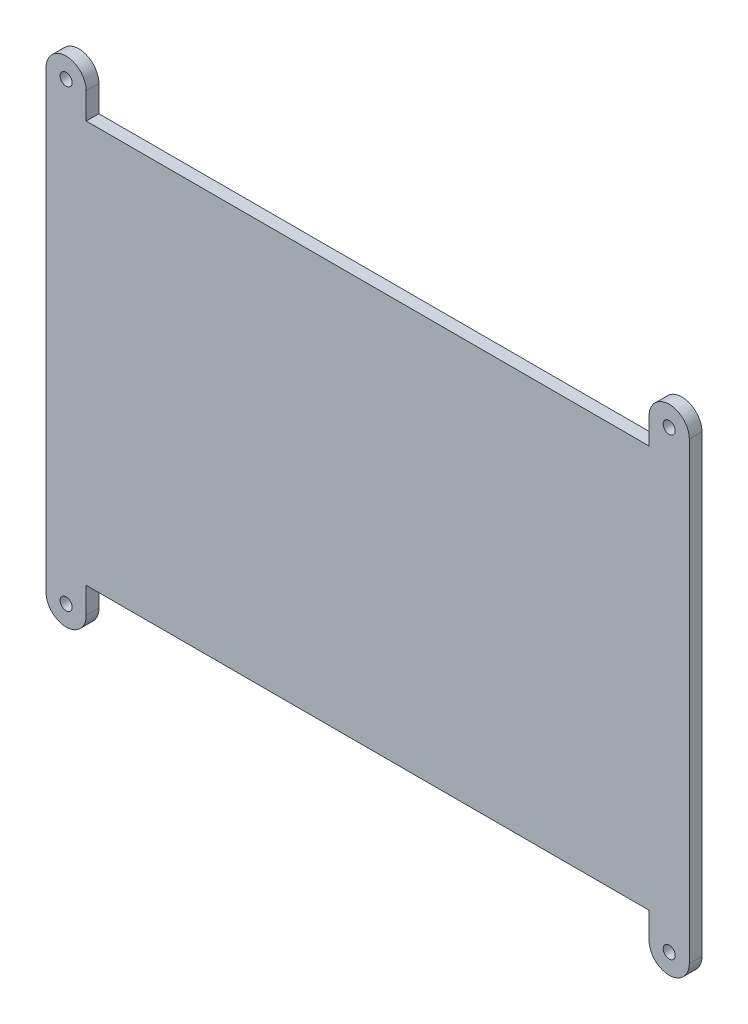
ISO-10303-21;
HEADER;
FILE_DESCRIPTION(('STEP AP214'),'2;1');
FILE_NAME('part.step','',(''),(''),'','','');
FILE_SCHEMA(('AUTOMOTIVE_DESIGN { 1 0 10303 214 1 1 1 1 }'));
ENDSEC;
DATA;
#1=APPLICATION_CONTEXT('core data for automotive mechanical design processes');
#2=APPLICATION_PROTOCOL_DEFINITION('international standard','automotive_design',2000,#1);
#3=PRODUCT_CONTEXT('',#1,'mechanical');
#4=PRODUCT('Part','Part','',(#3));
#5=PRODUCT_RELATED_PRODUCT_CATEGORY('part','',(#4));
#6=PRODUCT_DEFINITION_FORMATION('','',#4);
#7=PRODUCT_DEFINITION_CONTEXT('part definition',#1,'design');
#8=PRODUCT_DEFINITION('design','',#6,#7);
#9=PRODUCT_DEFINITION_SHAPE('','',#8);
#10=(LENGTH_UNIT() NAMED_UNIT(*) SI_UNIT(.MILLI.,.METRE.));
#11=(NAMED_UNIT(*) PLANE_ANGLE_UNIT() SI_UNIT($,.RADIAN.));
#12=(NAMED_UNIT(*) SI_UNIT($,.STERADIAN.) SOLID_ANGLE_UNIT());
#13=UNCERTAINTY_MEASURE_WITH_UNIT(LENGTH_MEASURE(1.E-05),#10,'distance_accuracy_value','');
#14=(GEOMETRIC_REPRESENTATION_CONTEXT(3) GLOBAL_UNCERTAINTY_ASSIGNED_CONTEXT((#13)) GLOBAL_UNIT_ASSIGNED_CONTEXT((#10,
#11,#12)) REPRESENTATION_CONTEXT('',''));
#15=CARTESIAN_POINT('',(0.,0.,0.));
#16=DIRECTION('',(0.,0.,1.));
#17=DIRECTION('',(1.,0.,0.));
#18=AXIS2_PLACEMENT_3D('',#15,#16,#17);
#19=CARTESIAN_POINT('',(-38.1000000000001,28.702,1.6));
#20=DIRECTION('',(0.,0.,-1.));
#21=DIRECTION('',(-1.,0.,0.));
#22=AXIS2_PLACEMENT_3D('',#19,#20,#21);
#23=CYLINDRICAL_SURFACE('',#22,2.5400000000001);
#24=CARTESIAN_POINT('',(-38.1000000000001,28.702,0.));
#25=DIRECTION('',(0.,0.,-1.));
#26=DIRECTION('',(-1.,0.,0.));
#27=AXIS2_PLACEMENT_3D('',#24,#25,#26);
#28=CIRCLE('',#27,2.5400000000001);
#29=CARTESIAN_POINT('',(-40.6400000000001,28.702,0.));
#30=VERTEX_POINT('',#29);
#31=CARTESIAN_POINT('',(-35.5599999999998,28.702,0.));
#32=VERTEX_POINT('',#31);
#33=EDGE_CURVE('E166',#30,#32,#28,.T.);
#34=ORIENTED_EDGE('',*,*,#33,.F.);
#35=DIRECTION('',(0.,0.,-1.));
#36=VECTOR('',#35,1.);
#37=CARTESIAN_POINT('',(-40.6400000000001,28.702,1.6));
#38=LINE('',#37,#36);
#39=CARTESIAN_POINT('',(-40.6400000000001,28.702,1.6));
#40=VERTEX_POINT('',#39);
#41=EDGE_CURVE('E11',#40,#30,#38,.T.);
#42=ORIENTED_EDGE('',*,*,#41,.F.);
#43=CARTESIAN_POINT('',(-38.1000000000001,28.702,1.6));
#44=DIRECTION('',(0.,0.,-1.));
#45=DIRECTION('',(-1.,0.,0.));
#46=AXIS2_PLACEMENT_3D('',#43,#44,#45);
#47=CIRCLE('',#46,2.5400000000001);
#48=CARTESIAN_POINT('',(-35.5599999999998,28.702,1.6));
#49=VERTEX_POINT('',#48);
#50=EDGE_CURVE('E208',#40,#49,#47,.T.);
#51=ORIENTED_EDGE('',*,*,#50,.T.);
#52=DIRECTION('',(0.,0.,-1.));
#53=VECTOR('',#52,1.);
#54=CARTESIAN_POINT('',(-35.5599999999998,28.702,1.6));
#55=LINE('',#54,#53);
#56=EDGE_CURVE('E41',#49,#32,#55,.T.);
#57=ORIENTED_EDGE('',*,*,#56,.T.);
#58=EDGE_LOOP('',(#34,#42,#51,#57));
#59=FACE_BOUND('',#58,.T.);
#60=ADVANCED_FACE('F38',(#59),#23,.T.);
#61=CARTESIAN_POINT('',(-40.6400000000001,28.702,1.6));
#62=DIRECTION('',(1.,0.,0.));
#63=DIRECTION('',(0.,1.,0.));
#64=AXIS2_PLACEMENT_3D('',#61,#62,#63);
#65=PLANE('',#64);
#66=DIRECTION('',(0.,-1.,0.));
#67=VECTOR('',#66,1.);
#68=CARTESIAN_POINT('',(-40.6400000000001,28.702,0.));
#69=LINE('',#68,#67);
#70=CARTESIAN_POINT('',(-40.6400000000001,-28.702,0.));
#71=VERTEX_POINT('',#70);
#72=EDGE_CURVE('E96',#30,#71,#69,.T.);
#73=ORIENTED_EDGE('',*,*,#72,.T.);
#74=DIRECTION('',(0.,0.,-1.));
#75=VECTOR('',#74,1.);
#76=CARTESIAN_POINT('',(-40.6400000000001,-28.702,1.6));
#77=LINE('',#76,#75);
#78=CARTESIAN_POINT('',(-40.6400000000001,-28.702,1.6));
#79=VERTEX_POINT('',#78);
#80=EDGE_CURVE('E48',#79,#71,#77,.T.);
#81=ORIENTED_EDGE('',*,*,#80,.F.);
#82=DIRECTION('',(0.,-1.,0.));
#83=VECTOR('',#82,1.);
#84=CARTESIAN_POINT('',(-40.6400000000001,28.702,1.6));
#85=LINE('',#84,#83);
#86=EDGE_CURVE('E139',#40,#79,#85,.T.);
#87=ORIENTED_EDGE('',*,*,#86,.F.);
#88=ORIENTED_EDGE('',*,*,#41,.T.);
#89=EDGE_LOOP('',(#73,#81,#87,#88));
#90=FACE_BOUND('',#89,.T.);
#91=ADVANCED_FACE('F336',(#90),#65,.F.);
#92=CARTESIAN_POINT('',(-38.0999999999999,-28.702,1.6));
#93=DIRECTION('',(0.,0.,-1.));
#94=DIRECTION('',(-1.,0.,0.));
#95=AXIS2_PLACEMENT_3D('',#92,#93,#94);
#96=CYLINDRICAL_SURFACE('',#95,2.54000000000011);
#97=CARTESIAN_POINT('',(-38.0999999999999,-28.702,0.));
#98=DIRECTION('',(0.,0.,1.));
#99=DIRECTION('',(1.,0.,0.));
#100=AXIS2_PLACEMENT_3D('',#97,#98,#99);
#101=CIRCLE('',#100,2.54000000000011);
#102=CARTESIAN_POINT('',(-35.5599999999998,-28.702,0.));
#103=VERTEX_POINT('',#102);
#104=EDGE_CURVE('E147',#71,#103,#101,.T.);
#105=ORIENTED_EDGE('',*,*,#104,.T.);
#106=DIRECTION('',(0.,0.,-1.));
#107=VECTOR('',#106,1.);
#108=CARTESIAN_POINT('',(-35.5599999999998,-28.702,1.6));
#109=LINE('',#108,#107);
#110=CARTESIAN_POINT('',(-35.5599999999998,-28.702,1.6));
#111=VERTEX_POINT('',#110);
#112=EDGE_CURVE('E144',#111,#103,#109,.T.);
#113=ORIENTED_EDGE('',*,*,#112,.F.);
#114=CARTESIAN_POINT('',(-38.0999999999999,-28.702,1.6));
#115=DIRECTION('',(0.,0.,1.));
#116=DIRECTION('',(1.,0.,0.));
#117=AXIS2_PLACEMENT_3D('',#114,#115,#116);
#118=CIRCLE('',#117,2.54000000000011);
#119=EDGE_CURVE('E134',#79,#111,#118,.T.);
#120=ORIENTED_EDGE('',*,*,#119,.F.);
#121=ORIENTED_EDGE('',*,*,#80,.T.);
#122=EDGE_LOOP('',(#105,#113,#120,#121));
#123=FACE_BOUND('',#122,.T.);
#124=ADVANCED_FACE('F145',(#123),#96,.T.);
#125=CARTESIAN_POINT('',(-35.5599999999999,-25.4,1.6));
#126=DIRECTION('',(1.,0.,0.));
#127=DIRECTION('',(0.,1.,0.));
#128=AXIS2_PLACEMENT_3D('',#125,#126,#127);
#129=PLANE('',#128);
#130=DIRECTION('',(0.,-1.,0.));
#131=VECTOR('',#130,1.);
#132=CARTESIAN_POINT('',(-35.5599999999999,-25.4,0.));
#133=LINE('',#132,#131);
#134=CARTESIAN_POINT('',(-35.5599999999999,-25.4,0.));
#135=VERTEX_POINT('',#134);
#136=EDGE_CURVE('E202',#135,#103,#133,.T.);
#137=ORIENTED_EDGE('',*,*,#136,.F.);
#138=DIRECTION('',(0.,0.,-1.));
#139=VECTOR('',#138,1.);
#140=CARTESIAN_POINT('',(-35.5599999999999,-25.4,1.6));
#141=LINE('',#140,#139);
#142=CARTESIAN_POINT('',(-35.5599999999999,-25.4,1.6));
#143=VERTEX_POINT('',#142);
#144=EDGE_CURVE('E152',#143,#135,#141,.T.);
#145=ORIENTED_EDGE('',*,*,#144,.F.);
#146=DIRECTION('',(0.,-1.,0.));
#147=VECTOR('',#146,1.);
#148=CARTESIAN_POINT('',(-35.5599999999999,-25.4,1.6));
#149=LINE('',#148,#147);
#150=EDGE_CURVE('E138',#143,#111,#149,.T.);
#151=ORIENTED_EDGE('',*,*,#150,.T.);
#152=ORIENTED_EDGE('',*,*,#112,.T.);
#153=EDGE_LOOP('',(#137,#145,#151,#152));
#154=FACE_BOUND('',#153,.T.);
#155=ADVANCED_FACE('F154',(#154),#129,.T.);
#156=CARTESIAN_POINT('',(-35.5599999999999,-25.4,1.6));
#157=DIRECTION('',(0.,1.,0.));
#158=DIRECTION('',(-1.,0.,0.));
#159=AXIS2_PLACEMENT_3D('',#156,#157,#158);
#160=PLANE('',#159);
#161=DIRECTION('',(1.,0.,0.));
#162=VECTOR('',#161,1.);
#163=CARTESIAN_POINT('',(-35.5599999999999,-25.4,0.));
#164=LINE('',#163,#162);
#165=CARTESIAN_POINT('',(35.5599999999999,-25.4,0.));
#166=VERTEX_POINT('',#165);
#167=EDGE_CURVE('E199',#135,#166,#164,.T.);
#168=ORIENTED_EDGE('',*,*,#167,.T.);
#169=DIRECTION('',(0.,0.,-1.));
#170=VECTOR('',#169,1.);
#171=CARTESIAN_POINT('',(35.5599999999999,-25.4,1.6));
#172=LINE('',#171,#170);
#173=CARTESIAN_POINT('',(35.5599999999999,-25.4,1.6));
#174=VERTEX_POINT('',#173);
#175=EDGE_CURVE('E214',#174,#166,#172,.T.);
#176=ORIENTED_EDGE('',*,*,#175,.F.);
#177=DIRECTION('',(1.,0.,0.));
#178=VECTOR('',#177,1.);
#179=CARTESIAN_POINT('',(-35.5599999999999,-25.4,1.6));
#180=LINE('',#179,#178);
#181=EDGE_CURVE('E157',#143,#174,#180,.T.);
#182=ORIENTED_EDGE('',*,*,#181,.F.);
#183=ORIENTED_EDGE('',*,*,#144,.T.);
#184=EDGE_LOOP('',(#168,#176,#182,#183));
#185=FACE_BOUND('',#184,.T.);
#186=ADVANCED_FACE('F245',(#185),#160,.F.);
#187=CARTESIAN_POINT('',(35.5599999999999,-25.4,1.6));
#188=DIRECTION('',(1.,0.,0.));
#189=DIRECTION('',(0.,1.,0.));
#190=AXIS2_PLACEMENT_3D('',#187,#188,#189);
#191=PLANE('',#190);
#192=DIRECTION('',(0.,-1.,0.));
#193=VECTOR('',#192,1.);
#194=CARTESIAN_POINT('',(35.5599999999999,-25.4,0.));
#195=LINE('',#194,#193);
#196=CARTESIAN_POINT('',(35.5599999999998,-28.702,0.));
#197=VERTEX_POINT('',#196);
#198=EDGE_CURVE('E195',#166,#197,#195,.T.);
#199=ORIENTED_EDGE('',*,*,#198,.T.);
#200=DIRECTION('',(0.,0.,-1.));
#201=VECTOR('',#200,1.);
#202=CARTESIAN_POINT('',(35.5599999999998,-28.702,1.6));
#203=LINE('',#202,#201);
#204=CARTESIAN_POINT('',(35.5599999999998,-28.702,1.6));
#205=VERTEX_POINT('',#204);
#206=EDGE_CURVE('E218',#205,#197,#203,.T.);
#207=ORIENTED_EDGE('',*,*,#206,.F.);
#208=DIRECTION('',(0.,-1.,0.));
#209=VECTOR('',#208,1.);
#210=CARTESIAN_POINT('',(35.5599999999999,-25.4,1.6));
#211=LINE('',#210,#209);
#212=EDGE_CURVE('E160',#174,#205,#211,.T.);
#213=ORIENTED_EDGE('',*,*,#212,.F.);
#214=ORIENTED_EDGE('',*,*,#175,.T.);
#215=EDGE_LOOP('',(#199,#207,#213,#214));
#216=FACE_BOUND('',#215,.T.);
#217=ADVANCED_FACE('F248',(#216),#191,.F.);
#218=CARTESIAN_POINT('',(38.0999999999999,-28.702,1.6));
#219=DIRECTION('',(0.,0.,-1.));
#220=DIRECTION('',(-1.,0.,0.));
#221=AXIS2_PLACEMENT_3D('',#218,#219,#220);
#222=CYLINDRICAL_SURFACE('',#221,2.54000000000012);
#223=CARTESIAN_POINT('',(38.0999999999999,-28.702,0.));
#224=DIRECTION('',(0.,0.,-1.));
#225=DIRECTION('',(-1.,0.,0.));
#226=AXIS2_PLACEMENT_3D('',#223,#224,#225);
#227=CIRCLE('',#226,2.54000000000012);
#228=CARTESIAN_POINT('',(40.6400000000001,-28.702,0.));
#229=VERTEX_POINT('',#228);
#230=EDGE_CURVE('E191',#229,#197,#227,.T.);
#231=ORIENTED_EDGE('',*,*,#230,.F.);
#232=DIRECTION('',(0.,0.,-1.));
#233=VECTOR('',#232,1.);
#234=CARTESIAN_POINT('',(40.6400000000001,-28.702,1.6));
#235=LINE('',#234,#233);
#236=CARTESIAN_POINT('',(40.6400000000001,-28.702,1.6));
#237=VERTEX_POINT('',#236);
#238=EDGE_CURVE('E221',#237,#229,#235,.T.);
#239=ORIENTED_EDGE('',*,*,#238,.F.);
#240=CARTESIAN_POINT('',(38.0999999999999,-28.702,1.6));
#241=DIRECTION('',(0.,0.,-1.));
#242=DIRECTION('',(-1.,0.,0.));
#243=AXIS2_PLACEMENT_3D('',#240,#241,#242);
#244=CIRCLE('',#243,2.54000000000012);
#245=EDGE_CURVE('E253',#237,#205,#244,.T.);
#246=ORIENTED_EDGE('',*,*,#245,.T.);
#247=ORIENTED_EDGE('',*,*,#206,.T.);
#248=EDGE_LOOP('',(#231,#239,#246,#247));
#249=FACE_BOUND('',#248,.T.);
#250=ADVANCED_FACE('F352',(#249),#222,.T.);
#251=CARTESIAN_POINT('',(40.6400000000001,28.702,1.6));
#252=DIRECTION('',(1.,0.,0.));
#253=DIRECTION('',(0.,1.,0.));
#254=AXIS2_PLACEMENT_3D('',#251,#252,#253);
#255=PLANE('',#254);
#256=DIRECTION('',(0.,-1.,0.));
#257=VECTOR('',#256,1.);
#258=CARTESIAN_POINT('',(40.6400000000001,28.702,0.));
#259=LINE('',#258,#257);
#260=CARTESIAN_POINT('',(40.6400000000001,28.702,0.));
#261=VERTEX_POINT('',#260);
#262=EDGE_CURVE('E187',#261,#229,#259,.T.);
#263=ORIENTED_EDGE('',*,*,#262,.F.);
#264=DIRECTION('',(0.,0.,-1.));
#265=VECTOR('',#264,1.);
#266=CARTESIAN_POINT('',(40.6400000000001,28.702,1.6));
#267=LINE('',#266,#265);
#268=CARTESIAN_POINT('',(40.6400000000001,28.702,1.6));
#269=VERTEX_POINT('',#268);
#270=EDGE_CURVE('E224',#269,#261,#267,.T.);
#271=ORIENTED_EDGE('',*,*,#270,.F.);
#272=DIRECTION('',(0.,-1.,0.));
#273=VECTOR('',#272,1.);
#274=CARTESIAN_POINT('',(40.6400000000001,28.702,1.6));
#275=LINE('',#274,#273);
#276=EDGE_CURVE('E255',#269,#237,#275,.T.);
#277=ORIENTED_EDGE('',*,*,#276,.T.);
#278=ORIENTED_EDGE('',*,*,#238,.T.);
#279=EDGE_LOOP('',(#263,#271,#277,#278));
#280=FACE_BOUND('',#279,.T.);
#281=ADVANCED_FACE('F355',(#280),#255,.T.);
#282=CARTESIAN_POINT('',(38.0999999999999,28.702,1.6));
#283=DIRECTION('',(0.,0.,-1.));
#284=DIRECTION('',(-1.,0.,0.));
#285=AXIS2_PLACEMENT_3D('',#282,#283,#284);
#286=CYLINDRICAL_SURFACE('',#285,2.5400000000001);
#287=CARTESIAN_POINT('',(38.0999999999999,28.702,0.));
#288=DIRECTION('',(0.,0.,1.));
#289=DIRECTION('',(1.,0.,0.));
#290=AXIS2_PLACEMENT_3D('',#287,#288,#289);
#291=CIRCLE('',#290,2.5400000000001);
#292=CARTESIAN_POINT('',(35.5599999999998,28.702,0.));
#293=VERTEX_POINT('',#292);
#294=EDGE_CURVE('E183',#261,#293,#291,.T.);
#295=ORIENTED_EDGE('',*,*,#294,.T.);
#296=DIRECTION('',(0.,0.,-1.));
#297=VECTOR('',#296,1.);
#298=CARTESIAN_POINT('',(35.5599999999998,28.702,1.6));
#299=LINE('',#298,#297);
#300=CARTESIAN_POINT('',(35.5599999999998,28.702,1.6));
#301=VERTEX_POINT('',#300);
#302=EDGE_CURVE('E227',#301,#293,#299,.T.);
#303=ORIENTED_EDGE('',*,*,#302,.F.);
#304=CARTESIAN_POINT('',(38.0999999999999,28.702,1.6));
#305=DIRECTION('',(0.,0.,1.));
#306=DIRECTION('',(1.,0.,0.));
#307=AXIS2_PLACEMENT_3D('',#304,#305,#306);
#308=CIRCLE('',#307,2.5400000000001);
#309=EDGE_CURVE('E261',#269,#301,#308,.T.);
#310=ORIENTED_EDGE('',*,*,#309,.F.);
#311=ORIENTED_EDGE('',*,*,#270,.T.);
#312=EDGE_LOOP('',(#295,#303,#310,#311));
#313=FACE_BOUND('',#312,.T.);
#314=ADVANCED_FACE('F359',(#313),#286,.T.);
#315=CARTESIAN_POINT('',(35.5599999999999,25.4,1.6));
#316=DIRECTION('',(-1.,0.,0.));
#317=DIRECTION('',(0.,-1.,0.));
#318=AXIS2_PLACEMENT_3D('',#315,#316,#317);
#319=PLANE('',#318);
#320=DIRECTION('',(0.,1.,0.));
#321=VECTOR('',#320,1.);
#322=CARTESIAN_POINT('',(35.5599999999999,25.4,0.));
#323=LINE('',#322,#321);
#324=CARTESIAN_POINT('',(35.5599999999999,25.4,0.));
#325=VERTEX_POINT('',#324);
#326=EDGE_CURVE('E179',#325,#293,#323,.T.);
#327=ORIENTED_EDGE('',*,*,#326,.F.);
#328=DIRECTION('',(0.,0.,-1.));
#329=VECTOR('',#328,1.);
#330=CARTESIAN_POINT('',(35.5599999999999,25.4,1.6));
#331=LINE('',#330,#329);
#332=CARTESIAN_POINT('',(35.5599999999999,25.4,1.6));
#333=VERTEX_POINT('',#332);
#334=EDGE_CURVE('E230',#333,#325,#331,.T.);
#335=ORIENTED_EDGE('',*,*,#334,.F.);
#336=DIRECTION('',(0.,1.,0.));
#337=VECTOR('',#336,1.);
#338=CARTESIAN_POINT('',(35.5599999999999,25.4,1.6));
#339=LINE('',#338,#337);
#340=EDGE_CURVE('E264',#333,#301,#339,.T.);
#341=ORIENTED_EDGE('',*,*,#340,.T.);
#342=ORIENTED_EDGE('',*,*,#302,.T.);
#343=EDGE_LOOP('',(#327,#335,#341,#342));
#344=FACE_BOUND('',#343,.T.);
#345=ADVANCED_FACE('F363',(#344),#319,.T.);
#346=CARTESIAN_POINT('',(-35.5599999999999,25.4,1.6));
#347=DIRECTION('',(0.,1.,0.));
#348=DIRECTION('',(-1.,0.,0.));
#349=AXIS2_PLACEMENT_3D('',#346,#347,#348);
#350=PLANE('',#349);
#351=DIRECTION('',(1.,0.,0.));
#352=VECTOR('',#351,1.);
#353=CARTESIAN_POINT('',(-35.5599999999999,25.4,0.));
#354=LINE('',#353,#352);
#355=CARTESIAN_POINT('',(-35.5599999999999,25.4,0.));
#356=VERTEX_POINT('',#355);
#357=EDGE_CURVE('E175',#356,#325,#354,.T.);
#358=ORIENTED_EDGE('',*,*,#357,.F.);
#359=DIRECTION('',(0.,0.,-1.));
#360=VECTOR('',#359,1.);
#361=CARTESIAN_POINT('',(-35.5599999999999,25.4,1.6));
#362=LINE('',#361,#360);
#363=CARTESIAN_POINT('',(-35.5599999999999,25.4,1.6));
#364=VERTEX_POINT('',#363);
#365=EDGE_CURVE('E232',#364,#356,#362,.T.);
#366=ORIENTED_EDGE('',*,*,#365,.F.);
#367=DIRECTION('',(1.,0.,0.));
#368=VECTOR('',#367,1.);
#369=CARTESIAN_POINT('',(-35.5599999999999,25.4,1.6));
#370=LINE('',#369,#368);
#371=EDGE_CURVE('E268',#364,#333,#370,.T.);
#372=ORIENTED_EDGE('',*,*,#371,.T.);
#373=ORIENTED_EDGE('',*,*,#334,.T.);
#374=EDGE_LOOP('',(#358,#366,#372,#373));
#375=FACE_BOUND('',#374,.T.);
#376=ADVANCED_FACE('F367',(#375),#350,.T.);
#377=CARTESIAN_POINT('',(-35.5599999999999,25.4,1.6));
#378=DIRECTION('',(-1.,0.,0.));
#379=DIRECTION('',(0.,-1.,0.));
#380=AXIS2_PLACEMENT_3D('',#377,#378,#379);
#381=PLANE('',#380);
#382=DIRECTION('',(0.,1.,0.));
#383=VECTOR('',#382,1.);
#384=CARTESIAN_POINT('',(-35.5599999999999,25.4,0.));
#385=LINE('',#384,#383);
#386=EDGE_CURVE('E170',#356,#32,#385,.T.);
#387=ORIENTED_EDGE('',*,*,#386,.T.);
#388=ORIENTED_EDGE('',*,*,#56,.F.);
#389=DIRECTION('',(0.,1.,0.));
#390=VECTOR('',#389,1.);
#391=CARTESIAN_POINT('',(-35.5599999999999,25.4,1.6));
#392=LINE('',#391,#390);
#393=EDGE_CURVE('E106',#364,#49,#392,.T.);
#394=ORIENTED_EDGE('',*,*,#393,.F.);
#395=ORIENTED_EDGE('',*,*,#365,.T.);
#396=EDGE_LOOP('',(#387,#388,#394,#395));
#397=FACE_BOUND('',#396,.T.);
#398=ADVANCED_FACE('F237',(#397),#381,.F.);
#399=CARTESIAN_POINT('',(-38.1000000000001,28.702,1.6));
#400=DIRECTION('',(0.,0.,-1.));
#401=DIRECTION('',(-1.,0.,0.));
#402=AXIS2_PLACEMENT_3D('',#399,#400,#401);
#403=PLANE('',#402);
#404=CARTESIAN_POINT('',(-38.0999999999999,28.702,1.6));
#405=DIRECTION('',(0.,0.,1.));
#406=DIRECTION('',(-1.,0.,0.));
#407=AXIS2_PLACEMENT_3D('',#404,#405,#406);
#408=CIRCLE('',#407,0.761999999999996);
#409=CARTESIAN_POINT('',(-38.8619999999999,28.702,1.6));
#410=VERTEX_POINT('',#409);
#411=EDGE_CURVE('E293',#410,#410,#408,.T.);
#412=ORIENTED_EDGE('',*,*,#411,.F.);
#413=EDGE_LOOP('',(#412));
#414=FACE_BOUND('',#413,.T.);
#415=CARTESIAN_POINT('',(38.0999999999999,-28.702,1.6));
#416=DIRECTION('',(0.,0.,1.));
#417=DIRECTION('',(-1.,0.,0.));
#418=AXIS2_PLACEMENT_3D('',#415,#416,#417);
#419=CIRCLE('',#418,0.761999999999996);
#420=CARTESIAN_POINT('',(37.3379999999999,-28.702,1.6));
#421=VERTEX_POINT('',#420);
#422=EDGE_CURVE('E284',#421,#421,#419,.T.);
#423=ORIENTED_EDGE('',*,*,#422,.F.);
#424=EDGE_LOOP('',(#423));
#425=FACE_BOUND('',#424,.T.);
#426=CARTESIAN_POINT('',(-38.0999999999999,-28.702,1.6));
#427=DIRECTION('',(0.,0.,1.));
#428=DIRECTION('',(1.,0.,0.));
#429=AXIS2_PLACEMENT_3D('',#426,#427,#428);
#430=CIRCLE('',#429,0.761999999999996);
#431=CARTESIAN_POINT('',(-37.3379999999999,-28.702,1.6));
#432=VERTEX_POINT('',#431);
#433=EDGE_CURVE('E300',#432,#432,#430,.T.);
#434=ORIENTED_EDGE('',*,*,#433,.F.);
#435=EDGE_LOOP('',(#434));
#436=FACE_BOUND('',#435,.T.);
#437=CARTESIAN_POINT('',(38.0999999999999,28.702,1.6));
#438=DIRECTION('',(0.,0.,1.));
#439=DIRECTION('',(1.,0.,0.));
#440=AXIS2_PLACEMENT_3D('',#437,#438,#439);
#441=CIRCLE('',#440,0.761999999999996);
#442=CARTESIAN_POINT('',(38.8619999999999,28.702,1.6));
#443=VERTEX_POINT('',#442);
#444=EDGE_CURVE('E276',#443,#443,#441,.T.);
#445=ORIENTED_EDGE('',*,*,#444,.F.);
#446=EDGE_LOOP('',(#445));
#447=FACE_BOUND('',#446,.T.);
#448=ORIENTED_EDGE('',*,*,#50,.F.);
#449=ORIENTED_EDGE('',*,*,#86,.T.);
#450=ORIENTED_EDGE('',*,*,#119,.T.);
#451=ORIENTED_EDGE('',*,*,#150,.F.);
#452=ORIENTED_EDGE('',*,*,#181,.T.);
#453=ORIENTED_EDGE('',*,*,#212,.T.);
#454=ORIENTED_EDGE('',*,*,#245,.F.);
#455=ORIENTED_EDGE('',*,*,#276,.F.);
#456=ORIENTED_EDGE('',*,*,#309,.T.);
#457=ORIENTED_EDGE('',*,*,#340,.F.);
#458=ORIENTED_EDGE('',*,*,#371,.F.);
#459=ORIENTED_EDGE('',*,*,#393,.T.);
#460=EDGE_LOOP('',(#448,#449,#450,#451,#452,#453,#454,#455,#456,#457,#458,#459));
#461=FACE_BOUND('',#460,.T.);
#462=ADVANCED_FACE('F136',(#414,#425,#436,#447,#461),#403,.F.);
#463=CARTESIAN_POINT('',(-38.1000000000001,28.702,0.));
#464=DIRECTION('',(0.,0.,-1.));
#465=DIRECTION('',(-1.,0.,0.));
#466=AXIS2_PLACEMENT_3D('',#463,#464,#465);
#467=PLANE('',#466);
#468=CARTESIAN_POINT('',(-38.0999999999999,28.702,0.));
#469=DIRECTION('',(0.,0.,1.));
#470=DIRECTION('',(-1.,0.,0.));
#471=AXIS2_PLACEMENT_3D('',#468,#469,#470);
#472=CIRCLE('',#471,0.761999999999996);
#473=CARTESIAN_POINT('',(-38.8619999999999,28.702,0.));
#474=VERTEX_POINT('',#473);
#475=EDGE_CURVE('E280',#474,#474,#472,.T.);
#476=ORIENTED_EDGE('',*,*,#475,.T.);
#477=EDGE_LOOP('',(#476));
#478=FACE_BOUND('',#477,.T.);
#479=CARTESIAN_POINT('',(38.0999999999999,-28.702,0.));
#480=DIRECTION('',(0.,0.,1.));
#481=DIRECTION('',(-1.,0.,0.));
#482=AXIS2_PLACEMENT_3D('',#479,#480,#481);
#483=CIRCLE('',#482,0.761999999999996);
#484=CARTESIAN_POINT('',(37.3379999999999,-28.702,0.));
#485=VERTEX_POINT('',#484);
#486=EDGE_CURVE('E288',#485,#485,#483,.T.);
#487=ORIENTED_EDGE('',*,*,#486,.T.);
#488=EDGE_LOOP('',(#487));
#489=FACE_BOUND('',#488,.T.);
#490=CARTESIAN_POINT('',(-38.0999999999999,-28.702,0.));
#491=DIRECTION('',(0.,0.,1.));
#492=DIRECTION('',(1.,0.,0.));
#493=AXIS2_PLACEMENT_3D('',#490,#491,#492);
#494=CIRCLE('',#493,0.761999999999996);
#495=CARTESIAN_POINT('',(-37.3379999999999,-28.702,0.));
#496=VERTEX_POINT('',#495);
#497=EDGE_CURVE('E289',#496,#496,#494,.T.);
#498=ORIENTED_EDGE('',*,*,#497,.T.);
#499=EDGE_LOOP('',(#498));
#500=FACE_BOUND('',#499,.T.);
#501=CARTESIAN_POINT('',(38.0999999999999,28.702,0.));
#502=DIRECTION('',(0.,0.,1.));
#503=DIRECTION('',(1.,0.,0.));
#504=AXIS2_PLACEMENT_3D('',#501,#502,#503);
#505=CIRCLE('',#504,0.761999999999996);
#506=CARTESIAN_POINT('',(38.8619999999999,28.702,0.));
#507=VERTEX_POINT('',#506);
#508=EDGE_CURVE('E171',#507,#507,#505,.T.);
#509=ORIENTED_EDGE('',*,*,#508,.T.);
#510=EDGE_LOOP('',(#509));
#511=FACE_BOUND('',#510,.T.);
#512=ORIENTED_EDGE('',*,*,#33,.T.);
#513=ORIENTED_EDGE('',*,*,#386,.F.);
#514=ORIENTED_EDGE('',*,*,#357,.T.);
#515=ORIENTED_EDGE('',*,*,#326,.T.);
#516=ORIENTED_EDGE('',*,*,#294,.F.);
#517=ORIENTED_EDGE('',*,*,#262,.T.);
#518=ORIENTED_EDGE('',*,*,#230,.T.);
#519=ORIENTED_EDGE('',*,*,#198,.F.);
#520=ORIENTED_EDGE('',*,*,#167,.F.);
#521=ORIENTED_EDGE('',*,*,#136,.T.);
#522=ORIENTED_EDGE('',*,*,#104,.F.);
#523=ORIENTED_EDGE('',*,*,#72,.F.);
#524=EDGE_LOOP('',(#512,#513,#514,#515,#516,#517,#518,#519,#520,#521,#522,#523));
#525=FACE_BOUND('',#524,.T.);
#526=ADVANCED_FACE('F240',(#478,#489,#500,#511,#525),#467,.T.);
#527=CARTESIAN_POINT('',(38.0999999999999,28.702,0.));
#528=DIRECTION('',(0.,0.,1.));
#529=DIRECTION('',(1.,0.,0.));
#530=AXIS2_PLACEMENT_3D('',#527,#528,#529);
#531=CYLINDRICAL_SURFACE('',#530,0.761999999999996);
#532=ORIENTED_EDGE('',*,*,#508,.F.);
#533=EDGE_LOOP('',(#532));
#534=FACE_BOUND('',#533,.T.);
#535=ORIENTED_EDGE('',*,*,#444,.T.);
#536=EDGE_LOOP('',(#535));
#537=FACE_BOUND('',#536,.T.);
#538=ADVANCED_FACE('F314',(#534,#537),#531,.F.);
#539=CARTESIAN_POINT('',(-38.0999999999999,-28.702,0.));
#540=DIRECTION('',(0.,0.,1.));
#541=DIRECTION('',(1.,0.,0.));
#542=AXIS2_PLACEMENT_3D('',#539,#540,#541);
#543=CYLINDRICAL_SURFACE('',#542,0.761999999999996);
#544=ORIENTED_EDGE('',*,*,#497,.F.);
#545=EDGE_LOOP('',(#544));
#546=FACE_BOUND('',#545,.T.);
#547=ORIENTED_EDGE('',*,*,#433,.T.);
#548=EDGE_LOOP('',(#547));
#549=FACE_BOUND('',#548,.T.);
#550=ADVANCED_FACE('F310',(#546,#549),#543,.F.);
#551=CARTESIAN_POINT('',(38.0999999999999,-28.702,0.));
#552=DIRECTION('',(0.,0.,1.));
#553=DIRECTION('',(1.,0.,0.));
#554=AXIS2_PLACEMENT_3D('',#551,#552,#553);
#555=CYLINDRICAL_SURFACE('',#554,0.761999999999996);
#556=ORIENTED_EDGE('',*,*,#486,.F.);
#557=EDGE_LOOP('',(#556));
#558=FACE_BOUND('',#557,.T.);
#559=ORIENTED_EDGE('',*,*,#422,.T.);
#560=EDGE_LOOP('',(#559));
#561=FACE_BOUND('',#560,.T.);
#562=ADVANCED_FACE('F313',(#558,#561),#555,.F.);
#563=CARTESIAN_POINT('',(-38.0999999999999,28.702,0.));
#564=DIRECTION('',(0.,0.,1.));
#565=DIRECTION('',(1.,0.,0.));
#566=AXIS2_PLACEMENT_3D('',#563,#564,#565);
#567=CYLINDRICAL_SURFACE('',#566,0.761999999999996);
#568=ORIENTED_EDGE('',*,*,#475,.F.);
#569=EDGE_LOOP('',(#568));
#570=FACE_BOUND('',#569,.T.);
#571=ORIENTED_EDGE('',*,*,#411,.T.);
#572=EDGE_LOOP('',(#571));
#573=FACE_BOUND('',#572,.T.);
#574=ADVANCED_FACE('F404',(#570,#573),#567,.F.);
#575=CLOSED_SHELL('',(#60,#91,#124,#155,#186,#217,#250,#281,#314,#345,#376,#398,#462,#526,#538,
#550,#562,#574));
#576=MANIFOLD_SOLID_BREP('B2',#575);
#577=ADVANCED_BREP_SHAPE_REPRESENTATION('',(#18,#576),#14);
#578=SHAPE_DEFINITION_REPRESENTATION(#9,#577);
ENDSEC;
END-ISO-10303-21;
